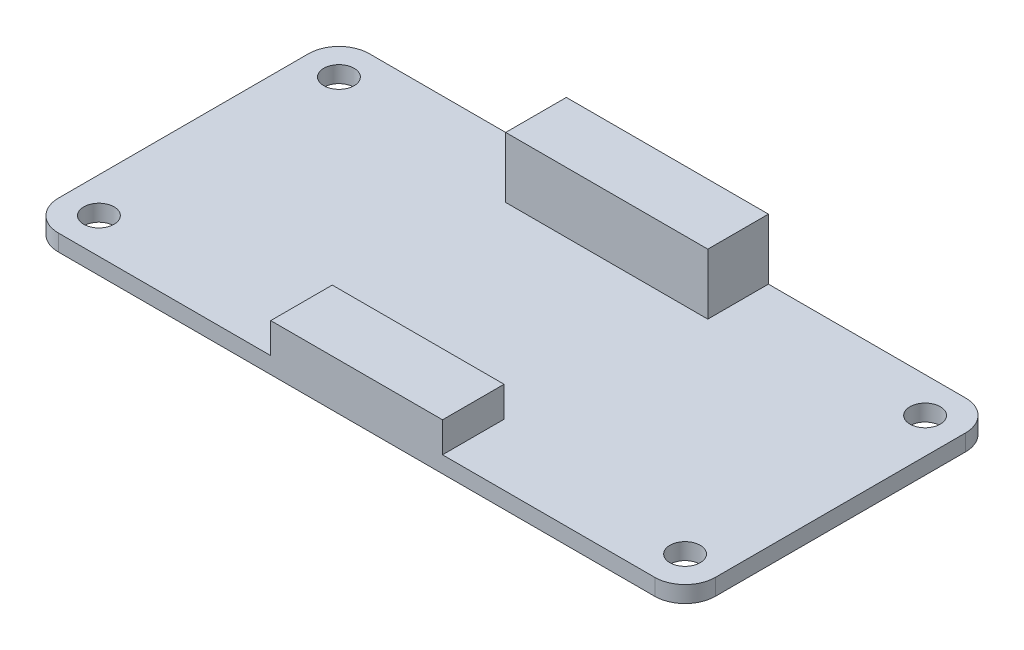
ISO-10303-21;
HEADER;
FILE_DESCRIPTION(('STEP AP214'),'2;1');
FILE_NAME('part.step','',(''),(''),'','','');
FILE_SCHEMA(('AUTOMOTIVE_DESIGN { 1 0 10303 214 1 1 1 1 }'));
ENDSEC;
DATA;
#1=APPLICATION_CONTEXT('core data for automotive mechanical design processes');
#2=APPLICATION_PROTOCOL_DEFINITION('international standard','automotive_design',2000,#1);
#3=PRODUCT_CONTEXT('',#1,'mechanical');
#4=PRODUCT('Part','Part','',(#3));
#5=PRODUCT_RELATED_PRODUCT_CATEGORY('part','',(#4));
#6=PRODUCT_DEFINITION_FORMATION('','',#4);
#7=PRODUCT_DEFINITION_CONTEXT('part definition',#1,'design');
#8=PRODUCT_DEFINITION('design','',#6,#7);
#9=PRODUCT_DEFINITION_SHAPE('','',#8);
#10=(LENGTH_UNIT() NAMED_UNIT(*) SI_UNIT(.MILLI.,.METRE.));
#11=(NAMED_UNIT(*) PLANE_ANGLE_UNIT() SI_UNIT($,.RADIAN.));
#12=(NAMED_UNIT(*) SI_UNIT($,.STERADIAN.) SOLID_ANGLE_UNIT());
#13=UNCERTAINTY_MEASURE_WITH_UNIT(LENGTH_MEASURE(1.E-05),#10,'distance_accuracy_value','');
#14=(GEOMETRIC_REPRESENTATION_CONTEXT(3) GLOBAL_UNCERTAINTY_ASSIGNED_CONTEXT((#13)) GLOBAL_UNIT_ASSIGNED_CONTEXT((#10,
#11,#12)) REPRESENTATION_CONTEXT('',''));
#15=CARTESIAN_POINT('',(0.,0.,0.));
#16=DIRECTION('',(0.,0.,1.));
#17=DIRECTION('',(1.,0.,0.));
#18=AXIS2_PLACEMENT_3D('',#15,#16,#17);
#19=CARTESIAN_POINT('',(-29.5,1.63,12.375));
#20=DIRECTION('',(0.,1.,0.));
#21=DIRECTION('',(0.,0.,1.));
#22=AXIS2_PLACEMENT_3D('',#19,#20,#21);
#23=PLANE('',#22);
#24=CARTESIAN_POINT('',(29.,1.63,-11.875));
#25=DIRECTION('',(0.,1.,0.));
#26=DIRECTION('',(0.,0.,1.));
#27=AXIS2_PLACEMENT_3D('',#24,#25,#26);
#28=CIRCLE('',#27,1.5);
#29=CARTESIAN_POINT('',(29.,1.63,-10.375));
#30=VERTEX_POINT('',#29);
#31=EDGE_CURVE('E259',#30,#30,#28,.T.);
#32=ORIENTED_EDGE('',*,*,#31,.F.);
#33=EDGE_LOOP('',(#32));
#34=FACE_BOUND('',#33,.T.);
#35=CARTESIAN_POINT('',(29.,1.63,11.875));
#36=DIRECTION('',(0.,1.,0.));
#37=DIRECTION('',(0.,0.,1.));
#38=AXIS2_PLACEMENT_3D('',#35,#36,#37);
#39=CIRCLE('',#38,1.5);
#40=CARTESIAN_POINT('',(29.,1.63,13.375));
#41=VERTEX_POINT('',#40);
#42=EDGE_CURVE('E270',#41,#41,#39,.T.);
#43=ORIENTED_EDGE('',*,*,#42,.F.);
#44=EDGE_LOOP('',(#43));
#45=FACE_BOUND('',#44,.T.);
#46=CARTESIAN_POINT('',(-29.,1.63,11.875));
#47=DIRECTION('',(0.,1.,0.));
#48=DIRECTION('',(0.,0.,1.));
#49=AXIS2_PLACEMENT_3D('',#46,#47,#48);
#50=CIRCLE('',#49,1.5);
#51=CARTESIAN_POINT('',(-29.,1.63,13.375));
#52=VERTEX_POINT('',#51);
#53=EDGE_CURVE('E264',#52,#52,#50,.T.);
#54=ORIENTED_EDGE('',*,*,#53,.F.);
#55=EDGE_LOOP('',(#54));
#56=FACE_BOUND('',#55,.T.);
#57=CARTESIAN_POINT('',(-29.,1.63,-11.875));
#58=DIRECTION('',(0.,1.,0.));
#59=DIRECTION('',(0.,0.,1.));
#60=AXIS2_PLACEMENT_3D('',#57,#58,#59);
#61=CIRCLE('',#60,1.5);
#62=CARTESIAN_POINT('',(-29.,1.63,-10.375));
#63=VERTEX_POINT('',#62);
#64=EDGE_CURVE('E263',#63,#63,#61,.T.);
#65=ORIENTED_EDGE('',*,*,#64,.F.);
#66=EDGE_LOOP('',(#65));
#67=FACE_BOUND('',#66,.T.);
#68=DIRECTION('',(1.,0.,0.));
#69=VECTOR('',#68,1.);
#70=CARTESIAN_POINT('',(-10.,1.63,-9.375));
#71=LINE('',#70,#69);
#72=CARTESIAN_POINT('',(-9.99999999999999,1.63,-9.375));
#73=VERTEX_POINT('',#72);
#74=CARTESIAN_POINT('',(10.,1.63,-9.375));
#75=VERTEX_POINT('',#74);
#76=EDGE_CURVE('E48',#73,#75,#71,.T.);
#77=ORIENTED_EDGE('',*,*,#76,.F.);
#78=DIRECTION('',(0.,0.,1.));
#79=VECTOR('',#78,1.);
#80=CARTESIAN_POINT('',(-10.,1.63,-15.375));
#81=LINE('',#80,#79);
#82=CARTESIAN_POINT('',(-10.,1.63,-15.375));
#83=VERTEX_POINT('',#82);
#84=EDGE_CURVE('E190',#83,#73,#81,.T.);
#85=ORIENTED_EDGE('',*,*,#84,.F.);
#86=DIRECTION('',(-1.,0.,0.));
#87=VECTOR('',#86,1.);
#88=CARTESIAN_POINT('',(-29.5,1.63,-15.375));
#89=LINE('',#88,#87);
#90=CARTESIAN_POINT('',(-29.5,1.63,-15.375));
#91=VERTEX_POINT('',#90);
#92=EDGE_CURVE('E297',#83,#91,#89,.T.);
#93=ORIENTED_EDGE('',*,*,#92,.T.);
#94=CARTESIAN_POINT('',(-29.5,1.63,-12.375));
#95=DIRECTION('',(0.,1.,0.));
#96=DIRECTION('',(0.,0.,1.));
#97=AXIS2_PLACEMENT_3D('',#94,#95,#96);
#98=CIRCLE('',#97,3.);
#99=CARTESIAN_POINT('',(-32.5,1.63,-12.375));
#100=VERTEX_POINT('',#99);
#101=EDGE_CURVE('E300',#91,#100,#98,.T.);
#102=ORIENTED_EDGE('',*,*,#101,.T.);
#103=DIRECTION('',(0.,0.,1.));
#104=VECTOR('',#103,1.);
#105=CARTESIAN_POINT('',(-32.5,1.63,-12.375));
#106=LINE('',#105,#104);
#107=CARTESIAN_POINT('',(-32.5,1.63,12.375));
#108=VERTEX_POINT('',#107);
#109=EDGE_CURVE('E302',#100,#108,#106,.T.);
#110=ORIENTED_EDGE('',*,*,#109,.T.);
#111=CARTESIAN_POINT('',(-29.5,1.63,12.375));
#112=DIRECTION('',(0.,1.,0.));
#113=DIRECTION('',(0.,0.,1.));
#114=AXIS2_PLACEMENT_3D('',#111,#112,#113);
#115=CIRCLE('',#114,3.);
#116=CARTESIAN_POINT('',(-29.5,1.63,15.375));
#117=VERTEX_POINT('',#116);
#118=EDGE_CURVE('E284',#108,#117,#115,.T.);
#119=ORIENTED_EDGE('',*,*,#118,.T.);
#120=DIRECTION('',(1.,0.,0.));
#121=VECTOR('',#120,1.);
#122=CARTESIAN_POINT('',(-29.5,1.63,15.375));
#123=LINE('',#122,#121);
#124=CARTESIAN_POINT('',(-8.50000000000003,1.63,15.375));
#125=VERTEX_POINT('',#124);
#126=EDGE_CURVE('E289',#117,#125,#123,.T.);
#127=ORIENTED_EDGE('',*,*,#126,.T.);
#128=DIRECTION('',(0.,0.,1.));
#129=VECTOR('',#128,1.);
#130=CARTESIAN_POINT('',(-8.50000000000002,1.63,15.375));
#131=LINE('',#130,#129);
#132=CARTESIAN_POINT('',(-8.50000000000002,1.63,9.28445982880919));
#133=VERTEX_POINT('',#132);
#134=EDGE_CURVE('E191',#133,#125,#131,.T.);
#135=ORIENTED_EDGE('',*,*,#134,.F.);
#136=DIRECTION('',(-1.,0.,0.));
#137=VECTOR('',#136,1.);
#138=CARTESIAN_POINT('',(-8.50000000000002,1.63,9.28445982880919));
#139=LINE('',#138,#137);
#140=CARTESIAN_POINT('',(8.49999999999999,1.63,9.28445982880919));
#141=VERTEX_POINT('',#140);
#142=EDGE_CURVE('E204',#141,#133,#139,.T.);
#143=ORIENTED_EDGE('',*,*,#142,.F.);
#144=DIRECTION('',(0.,0.,-1.));
#145=VECTOR('',#144,1.);
#146=CARTESIAN_POINT('',(8.49999999999999,1.63,15.375));
#147=LINE('',#146,#145);
#148=CARTESIAN_POINT('',(8.49999999999997,1.63,15.375));
#149=VERTEX_POINT('',#148);
#150=EDGE_CURVE('E194',#149,#141,#147,.T.);
#151=ORIENTED_EDGE('',*,*,#150,.F.);
#152=CARTESIAN_POINT('',(29.5,1.63,15.375));
#153=VERTEX_POINT('',#152);
#154=EDGE_CURVE('E287',#149,#153,#123,.T.);
#155=ORIENTED_EDGE('',*,*,#154,.T.);
#156=CARTESIAN_POINT('',(29.5,1.63,12.375));
#157=DIRECTION('',(0.,1.,0.));
#158=DIRECTION('',(0.,0.,1.));
#159=AXIS2_PLACEMENT_3D('',#156,#157,#158);
#160=CIRCLE('',#159,3.);
#161=CARTESIAN_POINT('',(32.5,1.63,12.375));
#162=VERTEX_POINT('',#161);
#163=EDGE_CURVE('E291',#153,#162,#160,.T.);
#164=ORIENTED_EDGE('',*,*,#163,.T.);
#165=DIRECTION('',(0.,0.,-1.));
#166=VECTOR('',#165,1.);
#167=CARTESIAN_POINT('',(32.5,1.63,-12.375));
#168=LINE('',#167,#166);
#169=CARTESIAN_POINT('',(32.5,1.63,-12.375));
#170=VERTEX_POINT('',#169);
#171=EDGE_CURVE('E293',#162,#170,#168,.T.);
#172=ORIENTED_EDGE('',*,*,#171,.T.);
#173=CARTESIAN_POINT('',(29.5,1.63,-12.375));
#174=DIRECTION('',(0.,1.,0.));
#175=DIRECTION('',(0.,0.,-1.));
#176=AXIS2_PLACEMENT_3D('',#173,#174,#175);
#177=CIRCLE('',#176,3.);
#178=CARTESIAN_POINT('',(29.5,1.63,-15.375));
#179=VERTEX_POINT('',#178);
#180=EDGE_CURVE('E295',#170,#179,#177,.T.);
#181=ORIENTED_EDGE('',*,*,#180,.T.);
#182=CARTESIAN_POINT('',(9.99999999999998,1.63,-15.375));
#183=VERTEX_POINT('',#182);
#184=EDGE_CURVE('E298',#179,#183,#89,.T.);
#185=ORIENTED_EDGE('',*,*,#184,.T.);
#186=DIRECTION('',(0.,0.,-1.));
#187=VECTOR('',#186,1.);
#188=CARTESIAN_POINT('',(10.,1.63,-15.375));
#189=LINE('',#188,#187);
#190=EDGE_CURVE('E53',#75,#183,#189,.T.);
#191=ORIENTED_EDGE('',*,*,#190,.F.);
#192=EDGE_LOOP('',(#77,#85,#93,#102,#110,#119,#127,#135,#143,#151,#155,#164,#172,#181,#185,#191));
#193=FACE_BOUND('',#192,.T.);
#194=ADVANCED_FACE('F33',(#34,#45,#56,#67,#193),#23,.T.);
#195=CARTESIAN_POINT('',(-29.5,0.,12.375));
#196=DIRECTION('',(0.,1.,0.));
#197=DIRECTION('',(0.,0.,1.));
#198=AXIS2_PLACEMENT_3D('',#195,#196,#197);
#199=PLANE('',#198);
#200=CARTESIAN_POINT('',(-29.5,0.,12.375));
#201=DIRECTION('',(0.,1.,0.));
#202=DIRECTION('',(0.,0.,1.));
#203=AXIS2_PLACEMENT_3D('',#200,#201,#202);
#204=CIRCLE('',#203,3.);
#205=CARTESIAN_POINT('',(-32.5,0.,12.375));
#206=VERTEX_POINT('',#205);
#207=CARTESIAN_POINT('',(-29.5,0.,15.375));
#208=VERTEX_POINT('',#207);
#209=EDGE_CURVE('E281',#206,#208,#204,.T.);
#210=ORIENTED_EDGE('',*,*,#209,.F.);
#211=DIRECTION('',(0.,0.,1.));
#212=VECTOR('',#211,1.);
#213=CARTESIAN_POINT('',(-32.5,0.,-12.375));
#214=LINE('',#213,#212);
#215=CARTESIAN_POINT('',(-32.5,0.,-12.375));
#216=VERTEX_POINT('',#215);
#217=EDGE_CURVE('E288',#216,#206,#214,.T.);
#218=ORIENTED_EDGE('',*,*,#217,.F.);
#219=CARTESIAN_POINT('',(-29.5,0.,-12.375));
#220=DIRECTION('',(0.,1.,0.));
#221=DIRECTION('',(0.,0.,1.));
#222=AXIS2_PLACEMENT_3D('',#219,#220,#221);
#223=CIRCLE('',#222,3.);
#224=CARTESIAN_POINT('',(-29.5,0.,-15.375));
#225=VERTEX_POINT('',#224);
#226=EDGE_CURVE('E317',#225,#216,#223,.T.);
#227=ORIENTED_EDGE('',*,*,#226,.F.);
#228=DIRECTION('',(-1.,0.,0.));
#229=VECTOR('',#228,1.);
#230=CARTESIAN_POINT('',(-29.5,0.,-15.375));
#231=LINE('',#230,#229);
#232=CARTESIAN_POINT('',(29.5,0.,-15.375));
#233=VERTEX_POINT('',#232);
#234=EDGE_CURVE('E315',#233,#225,#231,.T.);
#235=ORIENTED_EDGE('',*,*,#234,.F.);
#236=CARTESIAN_POINT('',(29.5,0.,-12.375));
#237=DIRECTION('',(0.,1.,0.));
#238=DIRECTION('',(0.,0.,-1.));
#239=AXIS2_PLACEMENT_3D('',#236,#237,#238);
#240=CIRCLE('',#239,3.);
#241=CARTESIAN_POINT('',(32.5,0.,-12.375));
#242=VERTEX_POINT('',#241);
#243=EDGE_CURVE('E313',#242,#233,#240,.T.);
#244=ORIENTED_EDGE('',*,*,#243,.F.);
#245=DIRECTION('',(0.,0.,-1.));
#246=VECTOR('',#245,1.);
#247=CARTESIAN_POINT('',(32.5,0.,-12.375));
#248=LINE('',#247,#246);
#249=CARTESIAN_POINT('',(32.5,0.,12.375));
#250=VERTEX_POINT('',#249);
#251=EDGE_CURVE('E311',#250,#242,#248,.T.);
#252=ORIENTED_EDGE('',*,*,#251,.F.);
#253=CARTESIAN_POINT('',(29.5,0.,12.375));
#254=DIRECTION('',(0.,1.,0.));
#255=DIRECTION('',(0.,0.,1.));
#256=AXIS2_PLACEMENT_3D('',#253,#254,#255);
#257=CIRCLE('',#256,3.);
#258=CARTESIAN_POINT('',(29.5,0.,15.375));
#259=VERTEX_POINT('',#258);
#260=EDGE_CURVE('E309',#259,#250,#257,.T.);
#261=ORIENTED_EDGE('',*,*,#260,.F.);
#262=DIRECTION('',(1.,0.,0.));
#263=VECTOR('',#262,1.);
#264=CARTESIAN_POINT('',(-29.5,0.,15.375));
#265=LINE('',#264,#263);
#266=EDGE_CURVE('E307',#208,#259,#265,.T.);
#267=ORIENTED_EDGE('',*,*,#266,.F.);
#268=EDGE_LOOP('',(#210,#218,#227,#235,#244,#252,#261,#267));
#269=FACE_BOUND('',#268,.T.);
#270=CARTESIAN_POINT('',(-29.,0.,-11.875));
#271=DIRECTION('',(0.,1.,0.));
#272=DIRECTION('',(0.,0.,1.));
#273=AXIS2_PLACEMENT_3D('',#270,#271,#272);
#274=CIRCLE('',#273,1.5);
#275=CARTESIAN_POINT('',(-29.,0.,-10.375));
#276=VERTEX_POINT('',#275);
#277=EDGE_CURVE('E278',#276,#276,#274,.T.);
#278=ORIENTED_EDGE('',*,*,#277,.T.);
#279=EDGE_LOOP('',(#278));
#280=FACE_BOUND('',#279,.T.);
#281=CARTESIAN_POINT('',(-29.,0.,11.875));
#282=DIRECTION('',(0.,1.,0.));
#283=DIRECTION('',(0.,0.,1.));
#284=AXIS2_PLACEMENT_3D('',#281,#282,#283);
#285=CIRCLE('',#284,1.5);
#286=CARTESIAN_POINT('',(-29.,0.,13.375));
#287=VERTEX_POINT('',#286);
#288=EDGE_CURVE('E260',#287,#287,#285,.T.);
#289=ORIENTED_EDGE('',*,*,#288,.T.);
#290=EDGE_LOOP('',(#289));
#291=FACE_BOUND('',#290,.T.);
#292=CARTESIAN_POINT('',(29.,0.,11.875));
#293=DIRECTION('',(0.,1.,0.));
#294=DIRECTION('',(0.,0.,1.));
#295=AXIS2_PLACEMENT_3D('',#292,#293,#294);
#296=CIRCLE('',#295,1.5);
#297=CARTESIAN_POINT('',(29.,0.,13.375));
#298=VERTEX_POINT('',#297);
#299=EDGE_CURVE('E267',#298,#298,#296,.T.);
#300=ORIENTED_EDGE('',*,*,#299,.T.);
#301=EDGE_LOOP('',(#300));
#302=FACE_BOUND('',#301,.T.);
#303=CARTESIAN_POINT('',(29.,0.,-11.875));
#304=DIRECTION('',(0.,1.,0.));
#305=DIRECTION('',(0.,0.,1.));
#306=AXIS2_PLACEMENT_3D('',#303,#304,#305);
#307=CIRCLE('',#306,1.5);
#308=CARTESIAN_POINT('',(29.,0.,-10.375));
#309=VERTEX_POINT('',#308);
#310=EDGE_CURVE('E273',#309,#309,#307,.T.);
#311=ORIENTED_EDGE('',*,*,#310,.T.);
#312=EDGE_LOOP('',(#311));
#313=FACE_BOUND('',#312,.T.);
#314=DIRECTION('',(0.,0.,-1.));
#315=VECTOR('',#314,1.);
#316=CARTESIAN_POINT('',(-25.7,0.,-8.735));
#317=LINE('',#316,#315);
#318=CARTESIAN_POINT('',(-25.7,0.,-8.735));
#319=VERTEX_POINT('',#318);
#320=CARTESIAN_POINT('',(-25.7,0.,-13.735));
#321=VERTEX_POINT('',#320);
#322=EDGE_CURVE('E226',#319,#321,#317,.T.);
#323=ORIENTED_EDGE('',*,*,#322,.F.);
#324=DIRECTION('',(-1.,0.,0.));
#325=VECTOR('',#324,1.);
#326=CARTESIAN_POINT('',(-25.7,0.,-8.735));
#327=LINE('',#326,#325);
#328=CARTESIAN_POINT('',(25.3,0.,-8.735));
#329=VERTEX_POINT('',#328);
#330=EDGE_CURVE('E231',#329,#319,#327,.T.);
#331=ORIENTED_EDGE('',*,*,#330,.F.);
#332=DIRECTION('',(0.,0.,1.));
#333=VECTOR('',#332,1.);
#334=CARTESIAN_POINT('',(25.3,0.,-8.735));
#335=LINE('',#334,#333);
#336=CARTESIAN_POINT('',(25.3,0.,-13.735));
#337=VERTEX_POINT('',#336);
#338=EDGE_CURVE('E243',#337,#329,#335,.T.);
#339=ORIENTED_EDGE('',*,*,#338,.F.);
#340=DIRECTION('',(1.,0.,0.));
#341=VECTOR('',#340,1.);
#342=CARTESIAN_POINT('',(-25.7,0.,-13.735));
#343=LINE('',#342,#341);
#344=EDGE_CURVE('E240',#321,#337,#343,.T.);
#345=ORIENTED_EDGE('',*,*,#344,.F.);
#346=EDGE_LOOP('',(#323,#331,#339,#345));
#347=FACE_BOUND('',#346,.T.);
#348=ADVANCED_FACE('F348',(#269,#280,#291,#302,#313,#347),#199,.F.);
#349=CARTESIAN_POINT('',(-29.5,1.63,12.375));
#350=DIRECTION('',(0.,-1.,0.));
#351=DIRECTION('',(0.,0.,-1.));
#352=AXIS2_PLACEMENT_3D('',#349,#350,#351);
#353=CYLINDRICAL_SURFACE('',#352,3.);
#354=ORIENTED_EDGE('',*,*,#209,.T.);
#355=DIRECTION('',(0.,-1.,0.));
#356=VECTOR('',#355,1.);
#357=CARTESIAN_POINT('',(-29.5,1.63,15.375));
#358=LINE('',#357,#356);
#359=EDGE_CURVE('E11',#117,#208,#358,.T.);
#360=ORIENTED_EDGE('',*,*,#359,.F.);
#361=ORIENTED_EDGE('',*,*,#118,.F.);
#362=DIRECTION('',(0.,-1.,0.));
#363=VECTOR('',#362,1.);
#364=CARTESIAN_POINT('',(-32.5,1.63,12.375));
#365=LINE('',#364,#363);
#366=EDGE_CURVE('E304',#108,#206,#365,.T.);
#367=ORIENTED_EDGE('',*,*,#366,.T.);
#368=EDGE_LOOP('',(#354,#360,#361,#367));
#369=FACE_BOUND('',#368,.T.);
#370=ADVANCED_FACE('F35',(#369),#353,.T.);
#371=CARTESIAN_POINT('',(-29.5,1.63,15.375));
#372=DIRECTION('',(0.,0.,-1.));
#373=DIRECTION('',(-1.,0.,0.));
#374=AXIS2_PLACEMENT_3D('',#371,#372,#373);
#375=PLANE('',#374);
#376=ORIENTED_EDGE('',*,*,#266,.T.);
#377=DIRECTION('',(0.,-1.,0.));
#378=VECTOR('',#377,1.);
#379=CARTESIAN_POINT('',(29.5,1.63,15.375));
#380=LINE('',#379,#378);
#381=EDGE_CURVE('E41',#153,#259,#380,.T.);
#382=ORIENTED_EDGE('',*,*,#381,.F.);
#383=ORIENTED_EDGE('',*,*,#154,.F.);
#384=DIRECTION('',(0.,-1.,0.));
#385=VECTOR('',#384,1.);
#386=CARTESIAN_POINT('',(8.49999999999999,4.63,15.375));
#387=LINE('',#386,#385);
#388=CARTESIAN_POINT('',(8.49999999999999,4.63,15.375));
#389=VERTEX_POINT('',#388);
#390=EDGE_CURVE('E220',#389,#149,#387,.T.);
#391=ORIENTED_EDGE('',*,*,#390,.F.);
#392=DIRECTION('',(1.,0.,0.));
#393=VECTOR('',#392,1.);
#394=CARTESIAN_POINT('',(-8.50000000000002,4.63,15.375));
#395=LINE('',#394,#393);
#396=CARTESIAN_POINT('',(-8.50000000000002,4.63,15.375));
#397=VERTEX_POINT('',#396);
#398=EDGE_CURVE('E203',#397,#389,#395,.T.);
#399=ORIENTED_EDGE('',*,*,#398,.F.);
#400=DIRECTION('',(0.,-1.,0.));
#401=VECTOR('',#400,1.);
#402=CARTESIAN_POINT('',(-8.50000000000002,4.63,15.375));
#403=LINE('',#402,#401);
#404=EDGE_CURVE('E223',#397,#125,#403,.T.);
#405=ORIENTED_EDGE('',*,*,#404,.T.);
#406=ORIENTED_EDGE('',*,*,#126,.F.);
#407=ORIENTED_EDGE('',*,*,#359,.T.);
#408=EDGE_LOOP('',(#376,#382,#383,#391,#399,#405,#406,#407));
#409=FACE_BOUND('',#408,.T.);
#410=ADVANCED_FACE('F362',(#409),#375,.F.);
#411=CARTESIAN_POINT('',(29.5,1.63,12.375));
#412=DIRECTION('',(0.,-1.,0.));
#413=DIRECTION('',(0.,0.,-1.));
#414=AXIS2_PLACEMENT_3D('',#411,#412,#413);
#415=CYLINDRICAL_SURFACE('',#414,3.);
#416=ORIENTED_EDGE('',*,*,#260,.T.);
#417=DIRECTION('',(0.,-1.,0.));
#418=VECTOR('',#417,1.);
#419=CARTESIAN_POINT('',(32.5,1.63,12.375));
#420=LINE('',#419,#418);
#421=EDGE_CURVE('E334',#162,#250,#420,.T.);
#422=ORIENTED_EDGE('',*,*,#421,.F.);
#423=ORIENTED_EDGE('',*,*,#163,.F.);
#424=ORIENTED_EDGE('',*,*,#381,.T.);
#425=EDGE_LOOP('',(#416,#422,#423,#424));
#426=FACE_BOUND('',#425,.T.);
#427=ADVANCED_FACE('F341',(#426),#415,.T.);
#428=CARTESIAN_POINT('',(32.5,1.63,-12.375));
#429=DIRECTION('',(-1.,0.,0.));
#430=DIRECTION('',(0.,0.,1.));
#431=AXIS2_PLACEMENT_3D('',#428,#429,#430);
#432=PLANE('',#431);
#433=ORIENTED_EDGE('',*,*,#251,.T.);
#434=DIRECTION('',(0.,-1.,0.));
#435=VECTOR('',#434,1.);
#436=CARTESIAN_POINT('',(32.5,1.63,-12.375));
#437=LINE('',#436,#435);
#438=EDGE_CURVE('E331',#170,#242,#437,.T.);
#439=ORIENTED_EDGE('',*,*,#438,.F.);
#440=ORIENTED_EDGE('',*,*,#171,.F.);
#441=ORIENTED_EDGE('',*,*,#421,.T.);
#442=EDGE_LOOP('',(#433,#439,#440,#441));
#443=FACE_BOUND('',#442,.T.);
#444=ADVANCED_FACE('F354',(#443),#432,.F.);
#445=CARTESIAN_POINT('',(29.5,1.63,-12.375));
#446=DIRECTION('',(0.,-1.,0.));
#447=DIRECTION('',(0.,0.,-1.));
#448=AXIS2_PLACEMENT_3D('',#445,#446,#447);
#449=CYLINDRICAL_SURFACE('',#448,3.);
#450=ORIENTED_EDGE('',*,*,#243,.T.);
#451=DIRECTION('',(0.,-1.,0.));
#452=VECTOR('',#451,1.);
#453=CARTESIAN_POINT('',(29.5,1.63,-15.375));
#454=LINE('',#453,#452);
#455=EDGE_CURVE('E328',#179,#233,#454,.T.);
#456=ORIENTED_EDGE('',*,*,#455,.F.);
#457=ORIENTED_EDGE('',*,*,#180,.F.);
#458=ORIENTED_EDGE('',*,*,#438,.T.);
#459=EDGE_LOOP('',(#450,#456,#457,#458));
#460=FACE_BOUND('',#459,.T.);
#461=ADVANCED_FACE('F358',(#460),#449,.T.);
#462=CARTESIAN_POINT('',(-29.5,1.63,-15.375));
#463=DIRECTION('',(0.,0.,1.));
#464=DIRECTION('',(1.,0.,0.));
#465=AXIS2_PLACEMENT_3D('',#462,#463,#464);
#466=PLANE('',#465);
#467=ORIENTED_EDGE('',*,*,#234,.T.);
#468=DIRECTION('',(0.,-1.,0.));
#469=VECTOR('',#468,1.);
#470=CARTESIAN_POINT('',(-29.5,1.63,-15.375));
#471=LINE('',#470,#469);
#472=EDGE_CURVE('E325',#91,#225,#471,.T.);
#473=ORIENTED_EDGE('',*,*,#472,.F.);
#474=ORIENTED_EDGE('',*,*,#92,.F.);
#475=DIRECTION('',(0.,-1.,0.));
#476=VECTOR('',#475,1.);
#477=CARTESIAN_POINT('',(-10.,7.63,-15.375));
#478=LINE('',#477,#476);
#479=CARTESIAN_POINT('',(-10.,7.63,-15.375));
#480=VERTEX_POINT('',#479);
#481=EDGE_CURVE('E437',#480,#83,#478,.T.);
#482=ORIENTED_EDGE('',*,*,#481,.F.);
#483=DIRECTION('',(-1.,0.,0.));
#484=VECTOR('',#483,1.);
#485=CARTESIAN_POINT('',(-10.,7.63,-15.375));
#486=LINE('',#485,#484);
#487=CARTESIAN_POINT('',(10.,7.63,-15.375));
#488=VERTEX_POINT('',#487);
#489=EDGE_CURVE('E184',#488,#480,#486,.T.);
#490=ORIENTED_EDGE('',*,*,#489,.F.);
#491=DIRECTION('',(0.,-1.,0.));
#492=VECTOR('',#491,1.);
#493=CARTESIAN_POINT('',(10.,7.63,-15.375));
#494=LINE('',#493,#492);
#495=EDGE_CURVE('E196',#488,#183,#494,.T.);
#496=ORIENTED_EDGE('',*,*,#495,.T.);
#497=ORIENTED_EDGE('',*,*,#184,.F.);
#498=ORIENTED_EDGE('',*,*,#455,.T.);
#499=EDGE_LOOP('',(#467,#473,#474,#482,#490,#496,#497,#498));
#500=FACE_BOUND('',#499,.T.);
#501=ADVANCED_FACE('F407',(#500),#466,.F.);
#502=CARTESIAN_POINT('',(-29.5,1.63,-12.375));
#503=DIRECTION('',(0.,-1.,0.));
#504=DIRECTION('',(0.,0.,-1.));
#505=AXIS2_PLACEMENT_3D('',#502,#503,#504);
#506=CYLINDRICAL_SURFACE('',#505,3.);
#507=ORIENTED_EDGE('',*,*,#226,.T.);
#508=DIRECTION('',(0.,-1.,0.));
#509=VECTOR('',#508,1.);
#510=CARTESIAN_POINT('',(-32.5,1.63,-12.375));
#511=LINE('',#510,#509);
#512=EDGE_CURVE('E322',#100,#216,#511,.T.);
#513=ORIENTED_EDGE('',*,*,#512,.F.);
#514=ORIENTED_EDGE('',*,*,#101,.F.);
#515=ORIENTED_EDGE('',*,*,#472,.T.);
#516=EDGE_LOOP('',(#507,#513,#514,#515));
#517=FACE_BOUND('',#516,.T.);
#518=ADVANCED_FACE('F403',(#517),#506,.T.);
#519=CARTESIAN_POINT('',(-32.5,1.63,-12.375));
#520=DIRECTION('',(1.,0.,0.));
#521=DIRECTION('',(0.,0.,-1.));
#522=AXIS2_PLACEMENT_3D('',#519,#520,#521);
#523=PLANE('',#522);
#524=ORIENTED_EDGE('',*,*,#217,.T.);
#525=ORIENTED_EDGE('',*,*,#366,.F.);
#526=ORIENTED_EDGE('',*,*,#109,.F.);
#527=ORIENTED_EDGE('',*,*,#512,.T.);
#528=EDGE_LOOP('',(#524,#525,#526,#527));
#529=FACE_BOUND('',#528,.T.);
#530=ADVANCED_FACE('F400',(#529),#523,.F.);
#531=CARTESIAN_POINT('',(-29.,0.,-11.875));
#532=DIRECTION('',(0.,1.,0.));
#533=DIRECTION('',(0.,0.,1.));
#534=AXIS2_PLACEMENT_3D('',#531,#532,#533);
#535=CYLINDRICAL_SURFACE('',#534,1.5);
#536=ORIENTED_EDGE('',*,*,#277,.F.);
#537=EDGE_LOOP('',(#536));
#538=FACE_BOUND('',#537,.T.);
#539=ORIENTED_EDGE('',*,*,#64,.T.);
#540=EDGE_LOOP('',(#539));
#541=FACE_BOUND('',#540,.T.);
#542=ADVANCED_FACE('F397',(#538,#541),#535,.F.);
#543=CARTESIAN_POINT('',(-29.,0.,11.875));
#544=DIRECTION('',(0.,1.,0.));
#545=DIRECTION('',(0.,0.,1.));
#546=AXIS2_PLACEMENT_3D('',#543,#544,#545);
#547=CYLINDRICAL_SURFACE('',#546,1.5);
#548=ORIENTED_EDGE('',*,*,#288,.F.);
#549=EDGE_LOOP('',(#548));
#550=FACE_BOUND('',#549,.T.);
#551=ORIENTED_EDGE('',*,*,#53,.T.);
#552=EDGE_LOOP('',(#551));
#553=FACE_BOUND('',#552,.T.);
#554=ADVANCED_FACE('F584',(#550,#553),#547,.F.);
#555=CARTESIAN_POINT('',(29.,0.,11.875));
#556=DIRECTION('',(0.,1.,0.));
#557=DIRECTION('',(0.,0.,1.));
#558=AXIS2_PLACEMENT_3D('',#555,#556,#557);
#559=CYLINDRICAL_SURFACE('',#558,1.5);
#560=ORIENTED_EDGE('',*,*,#299,.F.);
#561=EDGE_LOOP('',(#560));
#562=FACE_BOUND('',#561,.T.);
#563=ORIENTED_EDGE('',*,*,#42,.T.);
#564=EDGE_LOOP('',(#563));
#565=FACE_BOUND('',#564,.T.);
#566=ADVANCED_FACE('F576',(#562,#565),#559,.F.);
#567=CARTESIAN_POINT('',(29.,0.,-11.875));
#568=DIRECTION('',(0.,1.,0.));
#569=DIRECTION('',(0.,0.,1.));
#570=AXIS2_PLACEMENT_3D('',#567,#568,#569);
#571=CYLINDRICAL_SURFACE('',#570,1.5);
#572=ORIENTED_EDGE('',*,*,#310,.F.);
#573=EDGE_LOOP('',(#572));
#574=FACE_BOUND('',#573,.T.);
#575=ORIENTED_EDGE('',*,*,#31,.T.);
#576=EDGE_LOOP('',(#575));
#577=FACE_BOUND('',#576,.T.);
#578=ADVANCED_FACE('F562',(#574,#577),#571,.F.);
#579=CARTESIAN_POINT('',(-25.7,-3.68,-8.735));
#580=DIRECTION('',(1.,0.,0.));
#581=DIRECTION('',(0.,0.,-1.));
#582=AXIS2_PLACEMENT_3D('',#579,#580,#581);
#583=PLANE('',#582);
#584=ORIENTED_EDGE('',*,*,#322,.T.);
#585=DIRECTION('',(0.,1.,0.));
#586=VECTOR('',#585,1.);
#587=CARTESIAN_POINT('',(-25.7,-3.68,-13.735));
#588=LINE('',#587,#586);
#589=CARTESIAN_POINT('',(-25.7,-3.68,-13.735));
#590=VERTEX_POINT('',#589);
#591=EDGE_CURVE('E256',#590,#321,#588,.T.);
#592=ORIENTED_EDGE('',*,*,#591,.F.);
#593=DIRECTION('',(0.,0.,-1.));
#594=VECTOR('',#593,1.);
#595=CARTESIAN_POINT('',(-25.7,-3.68,-8.735));
#596=LINE('',#595,#594);
#597=CARTESIAN_POINT('',(-25.7,-3.68,-8.735));
#598=VERTEX_POINT('',#597);
#599=EDGE_CURVE('E227',#598,#590,#596,.T.);
#600=ORIENTED_EDGE('',*,*,#599,.F.);
#601=DIRECTION('',(0.,1.,0.));
#602=VECTOR('',#601,1.);
#603=CARTESIAN_POINT('',(-25.7,-3.68,-8.735));
#604=LINE('',#603,#602);
#605=EDGE_CURVE('E237',#598,#319,#604,.T.);
#606=ORIENTED_EDGE('',*,*,#605,.T.);
#607=EDGE_LOOP('',(#584,#592,#600,#606));
#608=FACE_BOUND('',#607,.T.);
#609=ADVANCED_FACE('F553',(#608),#583,.F.);
#610=CARTESIAN_POINT('',(-25.7,-3.68,-13.735));
#611=DIRECTION('',(0.,0.,1.));
#612=DIRECTION('',(1.,0.,0.));
#613=AXIS2_PLACEMENT_3D('',#610,#611,#612);
#614=PLANE('',#613);
#615=ORIENTED_EDGE('',*,*,#344,.T.);
#616=DIRECTION('',(0.,1.,0.));
#617=VECTOR('',#616,1.);
#618=CARTESIAN_POINT('',(25.3,-3.68,-13.735));
#619=LINE('',#618,#617);
#620=CARTESIAN_POINT('',(25.3,-3.68,-13.735));
#621=VERTEX_POINT('',#620);
#622=EDGE_CURVE('E253',#621,#337,#619,.T.);
#623=ORIENTED_EDGE('',*,*,#622,.F.);
#624=DIRECTION('',(1.,0.,0.));
#625=VECTOR('',#624,1.);
#626=CARTESIAN_POINT('',(-25.7,-3.68,-13.735));
#627=LINE('',#626,#625);
#628=EDGE_CURVE('E230',#590,#621,#627,.T.);
#629=ORIENTED_EDGE('',*,*,#628,.F.);
#630=ORIENTED_EDGE('',*,*,#591,.T.);
#631=EDGE_LOOP('',(#615,#623,#629,#630));
#632=FACE_BOUND('',#631,.T.);
#633=ADVANCED_FACE('F544',(#632),#614,.F.);
#634=CARTESIAN_POINT('',(25.3,-3.68,-8.735));
#635=DIRECTION('',(-1.,0.,0.));
#636=DIRECTION('',(0.,0.,1.));
#637=AXIS2_PLACEMENT_3D('',#634,#635,#636);
#638=PLANE('',#637);
#639=ORIENTED_EDGE('',*,*,#338,.T.);
#640=DIRECTION('',(0.,1.,0.));
#641=VECTOR('',#640,1.);
#642=CARTESIAN_POINT('',(25.3,-3.68,-8.735));
#643=LINE('',#642,#641);
#644=CARTESIAN_POINT('',(25.3,-3.68,-8.735));
#645=VERTEX_POINT('',#644);
#646=EDGE_CURVE('E250',#645,#329,#643,.T.);
#647=ORIENTED_EDGE('',*,*,#646,.F.);
#648=DIRECTION('',(0.,0.,1.));
#649=VECTOR('',#648,1.);
#650=CARTESIAN_POINT('',(25.3,-3.68,-8.735));
#651=LINE('',#650,#649);
#652=EDGE_CURVE('E233',#621,#645,#651,.T.);
#653=ORIENTED_EDGE('',*,*,#652,.F.);
#654=ORIENTED_EDGE('',*,*,#622,.T.);
#655=EDGE_LOOP('',(#639,#647,#653,#654));
#656=FACE_BOUND('',#655,.T.);
#657=ADVANCED_FACE('F535',(#656),#638,.F.);
#658=CARTESIAN_POINT('',(-25.7,-3.68,-8.735));
#659=DIRECTION('',(0.,0.,-1.));
#660=DIRECTION('',(-1.,0.,0.));
#661=AXIS2_PLACEMENT_3D('',#658,#659,#660);
#662=PLANE('',#661);
#663=ORIENTED_EDGE('',*,*,#330,.T.);
#664=ORIENTED_EDGE('',*,*,#605,.F.);
#665=DIRECTION('',(-1.,0.,0.));
#666=VECTOR('',#665,1.);
#667=CARTESIAN_POINT('',(-25.7,-3.68,-8.735));
#668=LINE('',#667,#666);
#669=EDGE_CURVE('E235',#645,#598,#668,.T.);
#670=ORIENTED_EDGE('',*,*,#669,.F.);
#671=ORIENTED_EDGE('',*,*,#646,.T.);
#672=EDGE_LOOP('',(#663,#664,#670,#671));
#673=FACE_BOUND('',#672,.T.);
#674=ADVANCED_FACE('F526',(#673),#662,.F.);
#675=CARTESIAN_POINT('',(0.,-3.68,0.));
#676=DIRECTION('',(0.,-1.,0.));
#677=DIRECTION('',(0.,0.,-1.));
#678=AXIS2_PLACEMENT_3D('',#675,#676,#677);
#679=PLANE('',#678);
#680=ORIENTED_EDGE('',*,*,#599,.T.);
#681=ORIENTED_EDGE('',*,*,#628,.T.);
#682=ORIENTED_EDGE('',*,*,#652,.T.);
#683=ORIENTED_EDGE('',*,*,#669,.T.);
#684=EDGE_LOOP('',(#680,#681,#682,#683));
#685=FACE_BOUND('',#684,.T.);
#686=ADVANCED_FACE('F510',(#685),#679,.T.);
#687=CARTESIAN_POINT('',(-8.50000000000002,4.63,15.375));
#688=DIRECTION('',(1.,0.,0.));
#689=DIRECTION('',(0.,0.,-1.));
#690=AXIS2_PLACEMENT_3D('',#687,#688,#689);
#691=PLANE('',#690);
#692=ORIENTED_EDGE('',*,*,#134,.T.);
#693=ORIENTED_EDGE('',*,*,#404,.F.);
#694=DIRECTION('',(0.,0.,1.));
#695=VECTOR('',#694,1.);
#696=CARTESIAN_POINT('',(-8.50000000000002,4.63,15.375));
#697=LINE('',#696,#695);
#698=CARTESIAN_POINT('',(-8.50000000000002,4.63,9.28445982880919));
#699=VERTEX_POINT('',#698);
#700=EDGE_CURVE('E200',#699,#397,#697,.T.);
#701=ORIENTED_EDGE('',*,*,#700,.F.);
#702=DIRECTION('',(0.,-1.,0.));
#703=VECTOR('',#702,1.);
#704=CARTESIAN_POINT('',(-8.50000000000002,4.63,9.28445982880919));
#705=LINE('',#704,#703);
#706=EDGE_CURVE('E209',#699,#133,#705,.T.);
#707=ORIENTED_EDGE('',*,*,#706,.T.);
#708=EDGE_LOOP('',(#692,#693,#701,#707));
#709=FACE_BOUND('',#708,.T.);
#710=ADVANCED_FACE('F374',(#709),#691,.F.);
#711=CARTESIAN_POINT('',(8.49999999999999,4.63,15.375));
#712=DIRECTION('',(-1.,0.,0.));
#713=DIRECTION('',(0.,0.,1.));
#714=AXIS2_PLACEMENT_3D('',#711,#712,#713);
#715=PLANE('',#714);
#716=ORIENTED_EDGE('',*,*,#150,.T.);
#717=DIRECTION('',(0.,-1.,0.));
#718=VECTOR('',#717,1.);
#719=CARTESIAN_POINT('',(8.49999999999999,4.63,9.28445982880919));
#720=LINE('',#719,#718);
#721=CARTESIAN_POINT('',(8.49999999999999,4.63,9.28445982880919));
#722=VERTEX_POINT('',#721);
#723=EDGE_CURVE('E217',#722,#141,#720,.T.);
#724=ORIENTED_EDGE('',*,*,#723,.F.);
#725=DIRECTION('',(0.,0.,-1.));
#726=VECTOR('',#725,1.);
#727=CARTESIAN_POINT('',(8.49999999999999,4.63,15.375));
#728=LINE('',#727,#726);
#729=EDGE_CURVE('E206',#389,#722,#728,.T.);
#730=ORIENTED_EDGE('',*,*,#729,.F.);
#731=ORIENTED_EDGE('',*,*,#390,.T.);
#732=EDGE_LOOP('',(#716,#724,#730,#731));
#733=FACE_BOUND('',#732,.T.);
#734=ADVANCED_FACE('F365',(#733),#715,.F.);
#735=CARTESIAN_POINT('',(-8.50000000000002,4.63,9.28445982880919));
#736=DIRECTION('',(0.,0.,1.));
#737=DIRECTION('',(1.,0.,0.));
#738=AXIS2_PLACEMENT_3D('',#735,#736,#737);
#739=PLANE('',#738);
#740=ORIENTED_EDGE('',*,*,#142,.T.);
#741=ORIENTED_EDGE('',*,*,#706,.F.);
#742=DIRECTION('',(-1.,0.,0.));
#743=VECTOR('',#742,1.);
#744=CARTESIAN_POINT('',(-8.50000000000002,4.63,9.28445982880919));
#745=LINE('',#744,#743);
#746=EDGE_CURVE('E208',#722,#699,#745,.T.);
#747=ORIENTED_EDGE('',*,*,#746,.F.);
#748=ORIENTED_EDGE('',*,*,#723,.T.);
#749=EDGE_LOOP('',(#740,#741,#747,#748));
#750=FACE_BOUND('',#749,.T.);
#751=ADVANCED_FACE('F376',(#750),#739,.F.);
#752=CARTESIAN_POINT('',(0.,4.63,0.));
#753=DIRECTION('',(0.,-1.,0.));
#754=DIRECTION('',(0.,0.,-1.));
#755=AXIS2_PLACEMENT_3D('',#752,#753,#754);
#756=PLANE('',#755);
#757=ORIENTED_EDGE('',*,*,#700,.T.);
#758=ORIENTED_EDGE('',*,*,#398,.T.);
#759=ORIENTED_EDGE('',*,*,#729,.T.);
#760=ORIENTED_EDGE('',*,*,#746,.T.);
#761=EDGE_LOOP('',(#757,#758,#759,#760));
#762=FACE_BOUND('',#761,.T.);
#763=ADVANCED_FACE('F369',(#762),#756,.F.);
#764=CARTESIAN_POINT('',(-10.,7.63,-15.375));
#765=DIRECTION('',(1.,0.,0.));
#766=DIRECTION('',(0.,0.,-1.));
#767=AXIS2_PLACEMENT_3D('',#764,#765,#766);
#768=PLANE('',#767);
#769=ORIENTED_EDGE('',*,*,#84,.T.);
#770=DIRECTION('',(0.,-1.,0.));
#771=VECTOR('',#770,1.);
#772=CARTESIAN_POINT('',(-10.,7.63,-9.375));
#773=LINE('',#772,#771);
#774=CARTESIAN_POINT('',(-10.,7.63,-9.375));
#775=VERTEX_POINT('',#774);
#776=EDGE_CURVE('E172',#775,#73,#773,.T.);
#777=ORIENTED_EDGE('',*,*,#776,.F.);
#778=DIRECTION('',(0.,0.,1.));
#779=VECTOR('',#778,1.);
#780=CARTESIAN_POINT('',(-10.,7.63,-15.375));
#781=LINE('',#780,#779);
#782=EDGE_CURVE('E179',#480,#775,#781,.T.);
#783=ORIENTED_EDGE('',*,*,#782,.F.);
#784=ORIENTED_EDGE('',*,*,#481,.T.);
#785=EDGE_LOOP('',(#769,#777,#783,#784));
#786=FACE_BOUND('',#785,.T.);
#787=ADVANCED_FACE('F189',(#786),#768,.F.);
#788=CARTESIAN_POINT('',(-10.,7.63,-9.375));
#789=DIRECTION('',(0.,0.,-1.));
#790=DIRECTION('',(-1.,0.,0.));
#791=AXIS2_PLACEMENT_3D('',#788,#789,#790);
#792=PLANE('',#791);
#793=ORIENTED_EDGE('',*,*,#76,.T.);
#794=DIRECTION('',(0.,-1.,0.));
#795=VECTOR('',#794,1.);
#796=CARTESIAN_POINT('',(10.,7.63,-9.375));
#797=LINE('',#796,#795);
#798=CARTESIAN_POINT('',(10.,7.63,-9.375));
#799=VERTEX_POINT('',#798);
#800=EDGE_CURVE('E175',#799,#75,#797,.T.);
#801=ORIENTED_EDGE('',*,*,#800,.F.);
#802=DIRECTION('',(1.,0.,0.));
#803=VECTOR('',#802,1.);
#804=CARTESIAN_POINT('',(-10.,7.63,-9.375));
#805=LINE('',#804,#803);
#806=EDGE_CURVE('E168',#775,#799,#805,.T.);
#807=ORIENTED_EDGE('',*,*,#806,.F.);
#808=ORIENTED_EDGE('',*,*,#776,.T.);
#809=EDGE_LOOP('',(#793,#801,#807,#808));
#810=FACE_BOUND('',#809,.T.);
#811=ADVANCED_FACE('F170',(#810),#792,.F.);
#812=CARTESIAN_POINT('',(10.,7.63,-15.375));
#813=DIRECTION('',(-1.,0.,0.));
#814=DIRECTION('',(0.,0.,1.));
#815=AXIS2_PLACEMENT_3D('',#812,#813,#814);
#816=PLANE('',#815);
#817=ORIENTED_EDGE('',*,*,#190,.T.);
#818=ORIENTED_EDGE('',*,*,#495,.F.);
#819=DIRECTION('',(0.,0.,-1.));
#820=VECTOR('',#819,1.);
#821=CARTESIAN_POINT('',(10.,7.63,-15.375));
#822=LINE('',#821,#820);
#823=EDGE_CURVE('E178',#799,#488,#822,.T.);
#824=ORIENTED_EDGE('',*,*,#823,.F.);
#825=ORIENTED_EDGE('',*,*,#800,.T.);
#826=EDGE_LOOP('',(#817,#818,#824,#825));
#827=FACE_BOUND('',#826,.T.);
#828=ADVANCED_FACE('F444',(#827),#816,.F.);
#829=CARTESIAN_POINT('',(0.,7.63,0.));
#830=DIRECTION('',(0.,1.,0.));
#831=DIRECTION('',(0.,0.,1.));
#832=AXIS2_PLACEMENT_3D('',#829,#830,#831);
#833=PLANE('',#832);
#834=ORIENTED_EDGE('',*,*,#782,.T.);
#835=ORIENTED_EDGE('',*,*,#806,.T.);
#836=ORIENTED_EDGE('',*,*,#823,.T.);
#837=ORIENTED_EDGE('',*,*,#489,.T.);
#838=EDGE_LOOP('',(#834,#835,#836,#837));
#839=FACE_BOUND('',#838,.T.);
#840=ADVANCED_FACE('F182',(#839),#833,.T.);
#841=CLOSED_SHELL('',(#194,#348,#370,#410,#427,#444,#461,#501,#518,#530,#542,#554,#566,#578,
#609,#633,#657,#674,#686,#710,#734,#751,#763,#787,#811,#828,#840));
#842=MANIFOLD_SOLID_BREP('B2',#841);
#843=ADVANCED_BREP_SHAPE_REPRESENTATION('',(#18,#842),#14);
#844=SHAPE_DEFINITION_REPRESENTATION(#9,#843);
ENDSEC;
END-ISO-10303-21;
